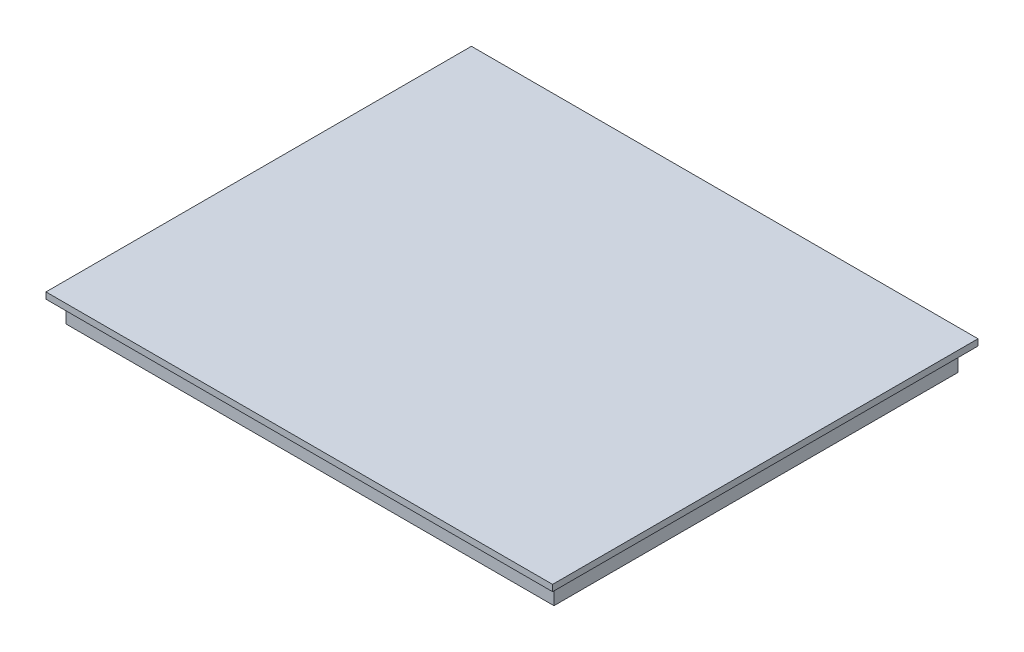
ISO-10303-21;
HEADER;
FILE_DESCRIPTION(('STEP AP214'),'2;1');
FILE_NAME('part.step','',(''),(''),'','','');
FILE_SCHEMA(('AUTOMOTIVE_DESIGN { 1 0 10303 214 1 1 1 1 }'));
ENDSEC;
DATA;
#1=APPLICATION_CONTEXT('core data for automotive mechanical design processes');
#2=APPLICATION_PROTOCOL_DEFINITION('international standard','automotive_design',2000,#1);
#3=PRODUCT_CONTEXT('',#1,'mechanical');
#4=PRODUCT('Part','Part','',(#3));
#5=PRODUCT_RELATED_PRODUCT_CATEGORY('part','',(#4));
#6=PRODUCT_DEFINITION_FORMATION('','',#4);
#7=PRODUCT_DEFINITION_CONTEXT('part definition',#1,'design');
#8=PRODUCT_DEFINITION('design','',#6,#7);
#9=PRODUCT_DEFINITION_SHAPE('','',#8);
#10=(LENGTH_UNIT() NAMED_UNIT(*) SI_UNIT(.MILLI.,.METRE.));
#11=(NAMED_UNIT(*) PLANE_ANGLE_UNIT() SI_UNIT($,.RADIAN.));
#12=(NAMED_UNIT(*) SI_UNIT($,.STERADIAN.) SOLID_ANGLE_UNIT());
#13=UNCERTAINTY_MEASURE_WITH_UNIT(LENGTH_MEASURE(1.E-05),#10,'distance_accuracy_value','');
#14=(GEOMETRIC_REPRESENTATION_CONTEXT(3) GLOBAL_UNCERTAINTY_ASSIGNED_CONTEXT((#13)) GLOBAL_UNIT_ASSIGNED_CONTEXT((#10,
#11,#12)) REPRESENTATION_CONTEXT('',''));
#15=CARTESIAN_POINT('',(0.,0.,0.));
#16=DIRECTION('',(0.,0.,1.));
#17=DIRECTION('',(1.,0.,0.));
#18=AXIS2_PLACEMENT_3D('',#15,#16,#17);
#19=CARTESIAN_POINT('',(38.35,3.5,-31.75));
#20=DIRECTION('',(-1.,0.,0.));
#21=DIRECTION('',(0.,0.,1.));
#22=AXIS2_PLACEMENT_3D('',#19,#20,#21);
#23=PLANE('',#22);
#24=DIRECTION('',(0.,0.,-1.));
#25=VECTOR('',#24,1.);
#26=CARTESIAN_POINT('',(38.35,0.,-31.75));
#27=LINE('',#26,#25);
#28=CARTESIAN_POINT('',(38.35,0.,31.75));
#29=VERTEX_POINT('',#28);
#30=CARTESIAN_POINT('',(38.35,0.,-31.75));
#31=VERTEX_POINT('',#30);
#32=EDGE_CURVE('E134',#29,#31,#27,.T.);
#33=ORIENTED_EDGE('',*,*,#32,.T.);
#34=DIRECTION('',(0.,-1.,0.));
#35=VECTOR('',#34,1.);
#36=CARTESIAN_POINT('',(38.35,3.5,-31.75));
#37=LINE('',#36,#35);
#38=CARTESIAN_POINT('',(38.35,3.5,-31.75));
#39=VERTEX_POINT('',#38);
#40=EDGE_CURVE('E11',#39,#31,#37,.T.);
#41=ORIENTED_EDGE('',*,*,#40,.F.);
#42=DIRECTION('',(0.,0.,-1.));
#43=VECTOR('',#42,1.);
#44=CARTESIAN_POINT('',(38.35,3.5,-31.75));
#45=LINE('',#44,#43);
#46=CARTESIAN_POINT('',(38.35,3.5,31.75));
#47=VERTEX_POINT('',#46);
#48=EDGE_CURVE('E143',#47,#39,#45,.T.);
#49=ORIENTED_EDGE('',*,*,#48,.F.);
#50=DIRECTION('',(0.,-1.,0.));
#51=VECTOR('',#50,1.);
#52=CARTESIAN_POINT('',(38.35,3.5,31.75));
#53=LINE('',#52,#51);
#54=EDGE_CURVE('E152',#47,#29,#53,.T.);
#55=ORIENTED_EDGE('',*,*,#54,.T.);
#56=EDGE_LOOP('',(#33,#41,#49,#55));
#57=FACE_BOUND('',#56,.T.);
#58=ADVANCED_FACE('F36',(#57),#23,.F.);
#59=CARTESIAN_POINT('',(-38.35,3.5,-31.75));
#60=DIRECTION('',(0.,0.,1.));
#61=DIRECTION('',(1.,0.,0.));
#62=AXIS2_PLACEMENT_3D('',#59,#60,#61);
#63=PLANE('',#62);
#64=DIRECTION('',(-1.,0.,0.));
#65=VECTOR('',#64,1.);
#66=CARTESIAN_POINT('',(-38.35,0.,-31.75));
#67=LINE('',#66,#65);
#68=CARTESIAN_POINT('',(-38.35,0.,-31.75));
#69=VERTEX_POINT('',#68);
#70=EDGE_CURVE('E137',#31,#69,#67,.T.);
#71=ORIENTED_EDGE('',*,*,#70,.T.);
#72=DIRECTION('',(0.,-1.,0.));
#73=VECTOR('',#72,1.);
#74=CARTESIAN_POINT('',(-38.35,3.5,-31.75));
#75=LINE('',#74,#73);
#76=CARTESIAN_POINT('',(-38.35,3.5,-31.75));
#77=VERTEX_POINT('',#76);
#78=EDGE_CURVE('E44',#77,#69,#75,.T.);
#79=ORIENTED_EDGE('',*,*,#78,.F.);
#80=DIRECTION('',(-1.,0.,0.));
#81=VECTOR('',#80,1.);
#82=CARTESIAN_POINT('',(-38.35,3.5,-31.75));
#83=LINE('',#82,#81);
#84=EDGE_CURVE('E78',#39,#77,#83,.T.);
#85=ORIENTED_EDGE('',*,*,#84,.F.);
#86=ORIENTED_EDGE('',*,*,#40,.T.);
#87=EDGE_LOOP('',(#71,#79,#85,#86));
#88=FACE_BOUND('',#87,.T.);
#89=ADVANCED_FACE('F178',(#88),#63,.F.);
#90=CARTESIAN_POINT('',(-38.35,3.5,-31.75));
#91=DIRECTION('',(1.,0.,0.));
#92=DIRECTION('',(0.,0.,-1.));
#93=AXIS2_PLACEMENT_3D('',#90,#91,#92);
#94=PLANE('',#93);
#95=DIRECTION('',(0.,0.,1.));
#96=VECTOR('',#95,1.);
#97=CARTESIAN_POINT('',(-38.35,0.,-31.75));
#98=LINE('',#97,#96);
#99=CARTESIAN_POINT('',(-38.35,0.,31.75));
#100=VERTEX_POINT('',#99);
#101=EDGE_CURVE('E68',#69,#100,#98,.T.);
#102=ORIENTED_EDGE('',*,*,#101,.T.);
#103=DIRECTION('',(0.,-1.,0.));
#104=VECTOR('',#103,1.);
#105=CARTESIAN_POINT('',(-38.35,3.5,31.75));
#106=LINE('',#105,#104);
#107=CARTESIAN_POINT('',(-38.35,3.5,31.75));
#108=VERTEX_POINT('',#107);
#109=EDGE_CURVE('E52',#108,#100,#106,.T.);
#110=ORIENTED_EDGE('',*,*,#109,.F.);
#111=DIRECTION('',(0.,0.,1.));
#112=VECTOR('',#111,1.);
#113=CARTESIAN_POINT('',(-38.35,3.5,-31.75));
#114=LINE('',#113,#112);
#115=EDGE_CURVE('E147',#77,#108,#114,.T.);
#116=ORIENTED_EDGE('',*,*,#115,.F.);
#117=ORIENTED_EDGE('',*,*,#78,.T.);
#118=EDGE_LOOP('',(#102,#110,#116,#117));
#119=FACE_BOUND('',#118,.T.);
#120=ADVANCED_FACE('F158',(#119),#94,.F.);
#121=CARTESIAN_POINT('',(-38.35,3.5,31.75));
#122=DIRECTION('',(0.,0.,-1.));
#123=DIRECTION('',(-1.,0.,0.));
#124=AXIS2_PLACEMENT_3D('',#121,#122,#123);
#125=PLANE('',#124);
#126=DIRECTION('',(1.,0.,0.));
#127=VECTOR('',#126,1.);
#128=CARTESIAN_POINT('',(-38.35,0.,31.75));
#129=LINE('',#128,#127);
#130=EDGE_CURVE('E73',#100,#29,#129,.T.);
#131=ORIENTED_EDGE('',*,*,#130,.T.);
#132=ORIENTED_EDGE('',*,*,#54,.F.);
#133=DIRECTION('',(1.,0.,0.));
#134=VECTOR('',#133,1.);
#135=CARTESIAN_POINT('',(-38.35,3.5,31.75));
#136=LINE('',#135,#134);
#137=EDGE_CURVE('E150',#108,#47,#136,.T.);
#138=ORIENTED_EDGE('',*,*,#137,.F.);
#139=ORIENTED_EDGE('',*,*,#109,.T.);
#140=EDGE_LOOP('',(#131,#132,#138,#139));
#141=FACE_BOUND('',#140,.T.);
#142=ADVANCED_FACE('F163',(#141),#125,.F.);
#143=CARTESIAN_POINT('',(0.,0.,0.));
#144=DIRECTION('',(0.,1.,0.));
#145=DIRECTION('',(0.,0.,1.));
#146=AXIS2_PLACEMENT_3D('',#143,#144,#145);
#147=PLANE('',#146);
#148=ORIENTED_EDGE('',*,*,#32,.F.);
#149=ORIENTED_EDGE('',*,*,#130,.F.);
#150=ORIENTED_EDGE('',*,*,#101,.F.);
#151=ORIENTED_EDGE('',*,*,#70,.F.);
#152=EDGE_LOOP('',(#148,#149,#150,#151));
#153=FACE_BOUND('',#152,.T.);
#154=ADVANCED_FACE('F161',(#153),#147,.F.);
#155=CARTESIAN_POINT('',(0.,3.5,0.));
#156=DIRECTION('',(0.,1.,0.));
#157=DIRECTION('',(0.,0.,1.));
#158=AXIS2_PLACEMENT_3D('',#155,#156,#157);
#159=PLANE('',#158);
#160=DIRECTION('',(0.,0.,-1.));
#161=VECTOR('',#160,1.);
#162=CARTESIAN_POINT('',(39.83,3.5,-33.45));
#163=LINE('',#162,#161);
#164=CARTESIAN_POINT('',(39.83,3.5,33.45));
#165=VERTEX_POINT('',#164);
#166=CARTESIAN_POINT('',(39.83,3.5,-33.45));
#167=VERTEX_POINT('',#166);
#168=EDGE_CURVE('E133',#165,#167,#163,.T.);
#169=ORIENTED_EDGE('',*,*,#168,.F.);
#170=DIRECTION('',(1.,0.,0.));
#171=VECTOR('',#170,1.);
#172=CARTESIAN_POINT('',(-39.83,3.5,33.45));
#173=LINE('',#172,#171);
#174=CARTESIAN_POINT('',(-39.83,3.5,33.45));
#175=VERTEX_POINT('',#174);
#176=EDGE_CURVE('E129',#175,#165,#173,.T.);
#177=ORIENTED_EDGE('',*,*,#176,.F.);
#178=DIRECTION('',(0.,0.,1.));
#179=VECTOR('',#178,1.);
#180=CARTESIAN_POINT('',(-39.83,3.5,-33.45));
#181=LINE('',#180,#179);
#182=CARTESIAN_POINT('',(-39.83,3.5,-33.45));
#183=VERTEX_POINT('',#182);
#184=EDGE_CURVE('E205',#183,#175,#181,.T.);
#185=ORIENTED_EDGE('',*,*,#184,.F.);
#186=DIRECTION('',(-1.,0.,0.));
#187=VECTOR('',#186,1.);
#188=CARTESIAN_POINT('',(-39.83,3.5,-33.45));
#189=LINE('',#188,#187);
#190=EDGE_CURVE('E208',#167,#183,#189,.T.);
#191=ORIENTED_EDGE('',*,*,#190,.F.);
#192=EDGE_LOOP('',(#169,#177,#185,#191));
#193=FACE_BOUND('',#192,.T.);
#194=ORIENTED_EDGE('',*,*,#137,.T.);
#195=ORIENTED_EDGE('',*,*,#48,.T.);
#196=ORIENTED_EDGE('',*,*,#84,.T.);
#197=ORIENTED_EDGE('',*,*,#115,.T.);
#198=EDGE_LOOP('',(#194,#195,#196,#197));
#199=FACE_BOUND('',#198,.T.);
#200=ADVANCED_FACE('F165',(#193,#199),#159,.F.);
#201=CARTESIAN_POINT('',(39.83,4.5,-33.45));
#202=DIRECTION('',(-1.,0.,0.));
#203=DIRECTION('',(0.,0.,1.));
#204=AXIS2_PLACEMENT_3D('',#201,#202,#203);
#205=PLANE('',#204);
#206=ORIENTED_EDGE('',*,*,#168,.T.);
#207=DIRECTION('',(0.,-1.,0.));
#208=VECTOR('',#207,1.);
#209=CARTESIAN_POINT('',(39.83,4.5,-33.45));
#210=LINE('',#209,#208);
#211=CARTESIAN_POINT('',(39.83,4.5,-33.45));
#212=VERTEX_POINT('',#211);
#213=EDGE_CURVE('E113',#212,#167,#210,.T.);
#214=ORIENTED_EDGE('',*,*,#213,.F.);
#215=DIRECTION('',(0.,0.,-1.));
#216=VECTOR('',#215,1.);
#217=CARTESIAN_POINT('',(39.83,4.5,-33.45));
#218=LINE('',#217,#216);
#219=CARTESIAN_POINT('',(39.83,4.5,33.45));
#220=VERTEX_POINT('',#219);
#221=EDGE_CURVE('E120',#220,#212,#218,.T.);
#222=ORIENTED_EDGE('',*,*,#221,.F.);
#223=DIRECTION('',(0.,-1.,0.));
#224=VECTOR('',#223,1.);
#225=CARTESIAN_POINT('',(39.83,4.5,33.45));
#226=LINE('',#225,#224);
#227=EDGE_CURVE('E202',#220,#165,#226,.T.);
#228=ORIENTED_EDGE('',*,*,#227,.T.);
#229=EDGE_LOOP('',(#206,#214,#222,#228));
#230=FACE_BOUND('',#229,.T.);
#231=ADVANCED_FACE('F131',(#230),#205,.F.);
#232=CARTESIAN_POINT('',(-39.83,4.5,-33.45));
#233=DIRECTION('',(0.,0.,1.));
#234=DIRECTION('',(1.,0.,0.));
#235=AXIS2_PLACEMENT_3D('',#232,#233,#234);
#236=PLANE('',#235);
#237=ORIENTED_EDGE('',*,*,#190,.T.);
#238=DIRECTION('',(0.,-1.,0.));
#239=VECTOR('',#238,1.);
#240=CARTESIAN_POINT('',(-39.83,4.5,-33.45));
#241=LINE('',#240,#239);
#242=CARTESIAN_POINT('',(-39.83,4.5,-33.45));
#243=VERTEX_POINT('',#242);
#244=EDGE_CURVE('E116',#243,#183,#241,.T.);
#245=ORIENTED_EDGE('',*,*,#244,.F.);
#246=DIRECTION('',(-1.,0.,0.));
#247=VECTOR('',#246,1.);
#248=CARTESIAN_POINT('',(-39.83,4.5,-33.45));
#249=LINE('',#248,#247);
#250=EDGE_CURVE('E109',#212,#243,#249,.T.);
#251=ORIENTED_EDGE('',*,*,#250,.F.);
#252=ORIENTED_EDGE('',*,*,#213,.T.);
#253=EDGE_LOOP('',(#237,#245,#251,#252));
#254=FACE_BOUND('',#253,.T.);
#255=ADVANCED_FACE('F111',(#254),#236,.F.);
#256=CARTESIAN_POINT('',(-39.83,4.5,-33.45));
#257=DIRECTION('',(1.,0.,0.));
#258=DIRECTION('',(0.,0.,-1.));
#259=AXIS2_PLACEMENT_3D('',#256,#257,#258);
#260=PLANE('',#259);
#261=ORIENTED_EDGE('',*,*,#184,.T.);
#262=DIRECTION('',(0.,-1.,0.));
#263=VECTOR('',#262,1.);
#264=CARTESIAN_POINT('',(-39.83,4.5,33.45));
#265=LINE('',#264,#263);
#266=CARTESIAN_POINT('',(-39.83,4.5,33.45));
#267=VERTEX_POINT('',#266);
#268=EDGE_CURVE('E139',#267,#175,#265,.T.);
#269=ORIENTED_EDGE('',*,*,#268,.F.);
#270=DIRECTION('',(0.,0.,1.));
#271=VECTOR('',#270,1.);
#272=CARTESIAN_POINT('',(-39.83,4.5,-33.45));
#273=LINE('',#272,#271);
#274=EDGE_CURVE('E119',#243,#267,#273,.T.);
#275=ORIENTED_EDGE('',*,*,#274,.F.);
#276=ORIENTED_EDGE('',*,*,#244,.T.);
#277=EDGE_LOOP('',(#261,#269,#275,#276));
#278=FACE_BOUND('',#277,.T.);
#279=ADVANCED_FACE('F191',(#278),#260,.F.);
#280=CARTESIAN_POINT('',(-39.83,4.5,33.45));
#281=DIRECTION('',(0.,0.,-1.));
#282=DIRECTION('',(-1.,0.,0.));
#283=AXIS2_PLACEMENT_3D('',#280,#281,#282);
#284=PLANE('',#283);
#285=ORIENTED_EDGE('',*,*,#176,.T.);
#286=ORIENTED_EDGE('',*,*,#227,.F.);
#287=DIRECTION('',(1.,0.,0.));
#288=VECTOR('',#287,1.);
#289=CARTESIAN_POINT('',(-39.83,4.5,33.45));
#290=LINE('',#289,#288);
#291=EDGE_CURVE('E125',#267,#220,#290,.T.);
#292=ORIENTED_EDGE('',*,*,#291,.F.);
#293=ORIENTED_EDGE('',*,*,#268,.T.);
#294=EDGE_LOOP('',(#285,#286,#292,#293));
#295=FACE_BOUND('',#294,.T.);
#296=ADVANCED_FACE('F193',(#295),#284,.F.);
#297=CARTESIAN_POINT('',(0.,4.5,0.));
#298=DIRECTION('',(0.,1.,0.));
#299=DIRECTION('',(0.,0.,1.));
#300=AXIS2_PLACEMENT_3D('',#297,#298,#299);
#301=PLANE('',#300);
#302=ORIENTED_EDGE('',*,*,#221,.T.);
#303=ORIENTED_EDGE('',*,*,#250,.T.);
#304=ORIENTED_EDGE('',*,*,#274,.T.);
#305=ORIENTED_EDGE('',*,*,#291,.T.);
#306=EDGE_LOOP('',(#302,#303,#304,#305));
#307=FACE_BOUND('',#306,.T.);
#308=ADVANCED_FACE('F123',(#307),#301,.T.);
#309=CLOSED_SHELL('',(#58,#89,#120,#142,#154,#200,#231,#255,#279,#296,#308));
#310=MANIFOLD_SOLID_BREP('B2',#309);
#311=ADVANCED_BREP_SHAPE_REPRESENTATION('',(#18,#310),#14);
#312=SHAPE_DEFINITION_REPRESENTATION(#9,#311);
ENDSEC;
END-ISO-10303-21;
